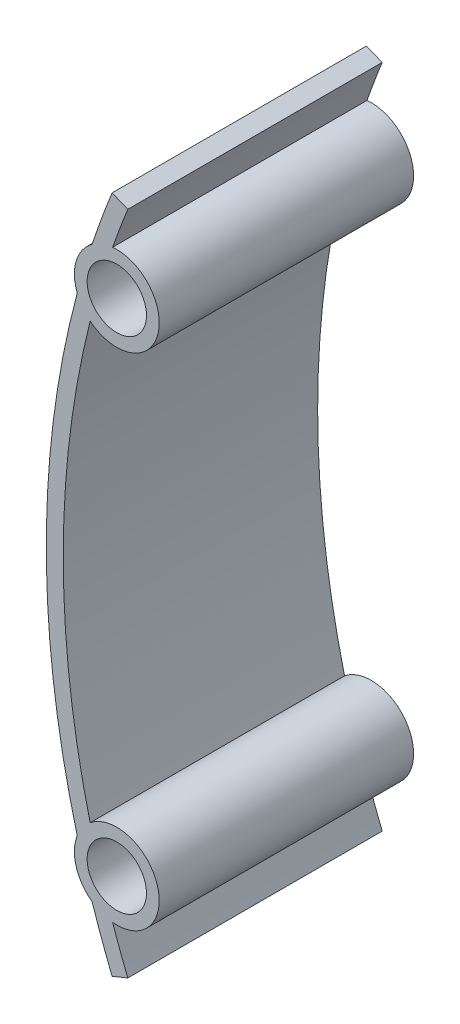
ISO-10303-21;
HEADER;
FILE_DESCRIPTION(('STEP AP214'),'2;1');
FILE_NAME('part.step','',(''),(''),'','','');
FILE_SCHEMA(('AUTOMOTIVE_DESIGN { 1 0 10303 214 1 1 1 1 }'));
ENDSEC;
DATA;
#1=APPLICATION_CONTEXT('core data for automotive mechanical design processes');
#2=APPLICATION_PROTOCOL_DEFINITION('international standard','automotive_design',2000,#1);
#3=PRODUCT_CONTEXT('',#1,'mechanical');
#4=PRODUCT('Part','Part','',(#3));
#5=PRODUCT_RELATED_PRODUCT_CATEGORY('part','',(#4));
#6=PRODUCT_DEFINITION_FORMATION('','',#4);
#7=PRODUCT_DEFINITION_CONTEXT('part definition',#1,'design');
#8=PRODUCT_DEFINITION('design','',#6,#7);
#9=PRODUCT_DEFINITION_SHAPE('','',#8);
#10=(LENGTH_UNIT() NAMED_UNIT(*) SI_UNIT(.MILLI.,.METRE.));
#11=(NAMED_UNIT(*) PLANE_ANGLE_UNIT() SI_UNIT($,.RADIAN.));
#12=(NAMED_UNIT(*) SI_UNIT($,.STERADIAN.) SOLID_ANGLE_UNIT());
#13=UNCERTAINTY_MEASURE_WITH_UNIT(LENGTH_MEASURE(1.E-05),#10,'distance_accuracy_value','');
#14=(GEOMETRIC_REPRESENTATION_CONTEXT(3) GLOBAL_UNCERTAINTY_ASSIGNED_CONTEXT((#13)) GLOBAL_UNIT_ASSIGNED_CONTEXT((#10,
#11,#12)) REPRESENTATION_CONTEXT('',''));
#15=CARTESIAN_POINT('',(0.,0.,0.));
#16=DIRECTION('',(0.,0.,1.));
#17=DIRECTION('',(1.,0.,0.));
#18=AXIS2_PLACEMENT_3D('',#15,#16,#17);
#19=CARTESIAN_POINT('',(107.,0.,30.));
#20=DIRECTION('',(0.,0.,1.));
#21=DIRECTION('',(1.,0.,0.));
#22=AXIS2_PLACEMENT_3D('',#19,#20,#21);
#23=PLANE('',#22);
#24=CARTESIAN_POINT('',(8.31489474089818,-29.5,30.));
#25=DIRECTION('',(0.,0.,1.));
#26=DIRECTION('',(1.,0.,0.));
#27=AXIS2_PLACEMENT_3D('',#24,#25,#26);
#28=CIRCLE('',#27,3.5);
#29=CARTESIAN_POINT('',(11.8148947408982,-29.5,30.));
#30=VERTEX_POINT('',#29);
#31=EDGE_CURVE('E162',#30,#30,#28,.T.);
#32=ORIENTED_EDGE('',*,*,#31,.F.);
#33=EDGE_LOOP('',(#32));
#34=FACE_BOUND('',#33,.T.);
#35=CARTESIAN_POINT('',(107.,0.,30.));
#36=DIRECTION('',(0.,0.,1.));
#37=DIRECTION('',(1.,0.,0.));
#38=AXIS2_PLACEMENT_3D('',#35,#36,#37);
#39=CIRCLE('',#38,107.);
#40=CARTESIAN_POINT('',(7.75787184869522,40.,30.));
#41=VERTEX_POINT('',#40);
#42=CARTESIAN_POINT('',(5.39998148846619,33.5624230122914,30.));
#43=VERTEX_POINT('',#42);
#44=EDGE_CURVE('E181',#41,#43,#39,.T.);
#45=ORIENTED_EDGE('',*,*,#44,.T.);
#46=CARTESIAN_POINT('',(8.31489474089818,29.5,30.));
#47=DIRECTION('',(0.,0.,1.));
#48=DIRECTION('',(1.,0.,0.));
#49=AXIS2_PLACEMENT_3D('',#46,#47,#48);
#50=CIRCLE('',#49,4.99999999999982);
#51=CARTESIAN_POINT('',(3.64866360779266,27.7038132022434,30.));
#52=VERTEX_POINT('',#51);
#53=EDGE_CURVE('E109',#43,#52,#50,.T.);
#54=ORIENTED_EDGE('',*,*,#53,.T.);
#55=CARTESIAN_POINT('',(107.,0.,30.));
#56=DIRECTION('',(0.,0.,1.));
#57=DIRECTION('',(1.,0.,0.));
#58=AXIS2_PLACEMENT_3D('',#55,#56,#57);
#59=CIRCLE('',#58,107.);
#60=CARTESIAN_POINT('',(3.64866360779257,-27.7038132022431,30.));
#61=VERTEX_POINT('',#60);
#62=EDGE_CURVE('E208',#52,#61,#59,.T.);
#63=ORIENTED_EDGE('',*,*,#62,.T.);
#64=CARTESIAN_POINT('',(8.31489474089818,-29.5,30.));
#65=DIRECTION('',(0.,0.,1.));
#66=DIRECTION('',(1.,0.,0.));
#67=AXIS2_PLACEMENT_3D('',#64,#65,#66);
#68=CIRCLE('',#67,5.00000000000001);
#69=CARTESIAN_POINT('',(5.39998148846628,-33.5624230122916,30.));
#70=VERTEX_POINT('',#69);
#71=EDGE_CURVE('E227',#61,#70,#68,.T.);
#72=ORIENTED_EDGE('',*,*,#71,.T.);
#73=CARTESIAN_POINT('',(107.,0.,30.));
#74=DIRECTION('',(0.,0.,1.));
#75=DIRECTION('',(1.,0.,0.));
#76=AXIS2_PLACEMENT_3D('',#73,#74,#75);
#77=CIRCLE('',#76,107.);
#78=CARTESIAN_POINT('',(7.75787184869522,-40.,30.));
#79=VERTEX_POINT('',#78);
#80=EDGE_CURVE('E224',#70,#79,#77,.T.);
#81=ORIENTED_EDGE('',*,*,#80,.T.);
#82=DIRECTION('',(0.92749652477855,0.373831775700932,0.));
#83=VECTOR('',#82,1.);
#84=CARTESIAN_POINT('',(7.75787184869522,-40.,30.));
#85=LINE('',#84,#83);
#86=CARTESIAN_POINT('',(9.61286489825233,-39.2523364485981,30.));
#87=VERTEX_POINT('',#86);
#88=EDGE_CURVE('E226',#79,#87,#85,.T.);
#89=ORIENTED_EDGE('',*,*,#88,.T.);
#90=CARTESIAN_POINT('',(107.,0.,30.));
#91=DIRECTION('',(0.,0.,-1.));
#92=DIRECTION('',(1.,0.,0.));
#93=AXIS2_PLACEMENT_3D('',#90,#91,#92);
#94=CIRCLE('',#93,105.);
#95=CARTESIAN_POINT('',(7.82119519222903,-34.4755663753631,30.));
#96=VERTEX_POINT('',#95);
#97=EDGE_CURVE('E229',#87,#96,#94,.T.);
#98=ORIENTED_EDGE('',*,*,#97,.T.);
#99=CARTESIAN_POINT('',(8.31489474089818,-29.5,30.));
#100=DIRECTION('',(0.,0.,1.));
#101=DIRECTION('',(1.,0.,0.));
#102=AXIS2_PLACEMENT_3D('',#99,#100,#101);
#103=CIRCLE('',#102,5.);
#104=CARTESIAN_POINT('',(5.17150538803955,-25.6116708760272,30.));
#105=VERTEX_POINT('',#104);
#106=EDGE_CURVE('E235',#96,#105,#103,.T.);
#107=ORIENTED_EDGE('',*,*,#106,.T.);
#108=CARTESIAN_POINT('',(107.,0.,30.));
#109=DIRECTION('',(0.,0.,-1.));
#110=DIRECTION('',(1.,0.,0.));
#111=AXIS2_PLACEMENT_3D('',#108,#109,#110);
#112=CIRCLE('',#111,105.);
#113=CARTESIAN_POINT('',(5.17150538803957,25.6116708760273,30.));
#114=VERTEX_POINT('',#113);
#115=EDGE_CURVE('E140',#105,#114,#112,.T.);
#116=ORIENTED_EDGE('',*,*,#115,.T.);
#117=CARTESIAN_POINT('',(8.31489474089818,29.5,30.));
#118=DIRECTION('',(0.,0.,1.));
#119=DIRECTION('',(1.,0.,0.));
#120=AXIS2_PLACEMENT_3D('',#117,#118,#119);
#121=CIRCLE('',#120,4.99999999999991);
#122=CARTESIAN_POINT('',(7.821195192229,34.475566375363,30.));
#123=VERTEX_POINT('',#122);
#124=EDGE_CURVE('E134',#114,#123,#121,.T.);
#125=ORIENTED_EDGE('',*,*,#124,.T.);
#126=CARTESIAN_POINT('',(107.,0.,30.));
#127=DIRECTION('',(0.,0.,-1.));
#128=DIRECTION('',(1.,0.,0.));
#129=AXIS2_PLACEMENT_3D('',#126,#127,#128);
#130=CIRCLE('',#129,105.);
#131=CARTESIAN_POINT('',(9.61286489825232,39.2523364485981,30.));
#132=VERTEX_POINT('',#131);
#133=EDGE_CURVE('E138',#123,#132,#130,.T.);
#134=ORIENTED_EDGE('',*,*,#133,.T.);
#135=DIRECTION('',(-0.927496524778549,0.373831775700935,0.));
#136=VECTOR('',#135,1.);
#137=CARTESIAN_POINT('',(7.75787184869522,40.,30.));
#138=LINE('',#137,#136);
#139=EDGE_CURVE('E54',#132,#41,#138,.T.);
#140=ORIENTED_EDGE('',*,*,#139,.T.);
#141=EDGE_LOOP('',(#45,#54,#63,#72,#81,#89,#98,#107,#116,#125,#134,#140));
#142=FACE_BOUND('',#141,.T.);
#143=CARTESIAN_POINT('',(8.31489474089818,29.5,30.));
#144=DIRECTION('',(0.,0.,1.));
#145=DIRECTION('',(1.,0.,0.));
#146=AXIS2_PLACEMENT_3D('',#143,#144,#145);
#147=CIRCLE('',#146,3.5);
#148=CARTESIAN_POINT('',(11.8148947408982,29.5,30.));
#149=VERTEX_POINT('',#148);
#150=EDGE_CURVE('E277',#149,#149,#147,.T.);
#151=ORIENTED_EDGE('',*,*,#150,.F.);
#152=EDGE_LOOP('',(#151));
#153=FACE_BOUND('',#152,.T.);
#154=ADVANCED_FACE('F37',(#34,#142,#153),#23,.T.);
#155=CARTESIAN_POINT('',(107.,0.,0.));
#156=DIRECTION('',(0.,0.,1.));
#157=DIRECTION('',(1.,0.,0.));
#158=AXIS2_PLACEMENT_3D('',#155,#156,#157);
#159=PLANE('',#158);
#160=CARTESIAN_POINT('',(107.,0.,0.));
#161=DIRECTION('',(0.,0.,1.));
#162=DIRECTION('',(1.,0.,0.));
#163=AXIS2_PLACEMENT_3D('',#160,#161,#162);
#164=CIRCLE('',#163,107.);
#165=CARTESIAN_POINT('',(7.75787184869522,40.,0.));
#166=VERTEX_POINT('',#165);
#167=CARTESIAN_POINT('',(5.39998148846619,33.5624230122914,0.));
#168=VERTEX_POINT('',#167);
#169=EDGE_CURVE('E158',#166,#168,#164,.T.);
#170=ORIENTED_EDGE('',*,*,#169,.F.);
#171=DIRECTION('',(-0.927496524778549,0.373831775700935,0.));
#172=VECTOR('',#171,1.);
#173=CARTESIAN_POINT('',(7.75787184869522,40.,0.));
#174=LINE('',#173,#172);
#175=CARTESIAN_POINT('',(9.61286489825232,39.2523364485981,0.));
#176=VERTEX_POINT('',#175);
#177=EDGE_CURVE('E101',#176,#166,#174,.T.);
#178=ORIENTED_EDGE('',*,*,#177,.F.);
#179=CARTESIAN_POINT('',(107.,0.,0.));
#180=DIRECTION('',(0.,0.,-1.));
#181=DIRECTION('',(1.,0.,0.));
#182=AXIS2_PLACEMENT_3D('',#179,#180,#181);
#183=CIRCLE('',#182,105.);
#184=CARTESIAN_POINT('',(7.821195192229,34.475566375363,0.));
#185=VERTEX_POINT('',#184);
#186=EDGE_CURVE('E95',#185,#176,#183,.T.);
#187=ORIENTED_EDGE('',*,*,#186,.F.);
#188=CARTESIAN_POINT('',(8.31489474089818,29.5,0.));
#189=DIRECTION('',(0.,0.,1.));
#190=DIRECTION('',(1.,0.,0.));
#191=AXIS2_PLACEMENT_3D('',#188,#189,#190);
#192=CIRCLE('',#191,4.99999999999991);
#193=CARTESIAN_POINT('',(5.17150538803957,25.6116708760273,0.));
#194=VERTEX_POINT('',#193);
#195=EDGE_CURVE('E148',#194,#185,#192,.T.);
#196=ORIENTED_EDGE('',*,*,#195,.F.);
#197=CARTESIAN_POINT('',(107.,0.,0.));
#198=DIRECTION('',(0.,0.,-1.));
#199=DIRECTION('',(1.,0.,0.));
#200=AXIS2_PLACEMENT_3D('',#197,#198,#199);
#201=CIRCLE('',#200,105.);
#202=CARTESIAN_POINT('',(5.17150538803955,-25.6116708760272,0.));
#203=VERTEX_POINT('',#202);
#204=EDGE_CURVE('E176',#203,#194,#201,.T.);
#205=ORIENTED_EDGE('',*,*,#204,.F.);
#206=CARTESIAN_POINT('',(8.31489474089818,-29.5,0.));
#207=DIRECTION('',(0.,0.,1.));
#208=DIRECTION('',(1.,0.,0.));
#209=AXIS2_PLACEMENT_3D('',#206,#207,#208);
#210=CIRCLE('',#209,5.);
#211=CARTESIAN_POINT('',(7.82119519222903,-34.4755663753631,0.));
#212=VERTEX_POINT('',#211);
#213=EDGE_CURVE('E174',#212,#203,#210,.T.);
#214=ORIENTED_EDGE('',*,*,#213,.F.);
#215=CARTESIAN_POINT('',(107.,0.,0.));
#216=DIRECTION('',(0.,0.,-1.));
#217=DIRECTION('',(1.,0.,0.));
#218=AXIS2_PLACEMENT_3D('',#215,#216,#217);
#219=CIRCLE('',#218,105.);
#220=CARTESIAN_POINT('',(9.61286489825233,-39.2523364485981,0.));
#221=VERTEX_POINT('',#220);
#222=EDGE_CURVE('E172',#221,#212,#219,.T.);
#223=ORIENTED_EDGE('',*,*,#222,.F.);
#224=DIRECTION('',(0.92749652477855,0.373831775700932,0.));
#225=VECTOR('',#224,1.);
#226=CARTESIAN_POINT('',(7.75787184869522,-40.,0.));
#227=LINE('',#226,#225);
#228=CARTESIAN_POINT('',(7.75787184869522,-40.,0.));
#229=VERTEX_POINT('',#228);
#230=EDGE_CURVE('E170',#229,#221,#227,.T.);
#231=ORIENTED_EDGE('',*,*,#230,.F.);
#232=CARTESIAN_POINT('',(107.,0.,0.));
#233=DIRECTION('',(0.,0.,1.));
#234=DIRECTION('',(1.,0.,0.));
#235=AXIS2_PLACEMENT_3D('',#232,#233,#234);
#236=CIRCLE('',#235,107.);
#237=CARTESIAN_POINT('',(5.39998148846628,-33.5624230122916,0.));
#238=VERTEX_POINT('',#237);
#239=EDGE_CURVE('E168',#238,#229,#236,.T.);
#240=ORIENTED_EDGE('',*,*,#239,.F.);
#241=CARTESIAN_POINT('',(8.31489474089818,-29.5,0.));
#242=DIRECTION('',(0.,0.,1.));
#243=DIRECTION('',(1.,0.,0.));
#244=AXIS2_PLACEMENT_3D('',#241,#242,#243);
#245=CIRCLE('',#244,5.00000000000001);
#246=CARTESIAN_POINT('',(3.64866360779257,-27.7038132022431,0.));
#247=VERTEX_POINT('',#246);
#248=EDGE_CURVE('E166',#247,#238,#245,.T.);
#249=ORIENTED_EDGE('',*,*,#248,.F.);
#250=CARTESIAN_POINT('',(107.,0.,0.));
#251=DIRECTION('',(0.,0.,1.));
#252=DIRECTION('',(1.,0.,0.));
#253=AXIS2_PLACEMENT_3D('',#250,#251,#252);
#254=CIRCLE('',#253,107.);
#255=CARTESIAN_POINT('',(3.64866360779266,27.7038132022434,0.));
#256=VERTEX_POINT('',#255);
#257=EDGE_CURVE('E164',#256,#247,#254,.T.);
#258=ORIENTED_EDGE('',*,*,#257,.F.);
#259=CARTESIAN_POINT('',(8.31489474089818,29.5,0.));
#260=DIRECTION('',(0.,0.,1.));
#261=DIRECTION('',(1.,0.,0.));
#262=AXIS2_PLACEMENT_3D('',#259,#260,#261);
#263=CIRCLE('',#262,4.99999999999982);
#264=EDGE_CURVE('E161',#168,#256,#263,.T.);
#265=ORIENTED_EDGE('',*,*,#264,.F.);
#266=EDGE_LOOP('',(#170,#178,#187,#196,#205,#214,#223,#231,#240,#249,#258,#265));
#267=FACE_BOUND('',#266,.T.);
#268=CARTESIAN_POINT('',(8.31489474089818,-29.5,0.));
#269=DIRECTION('',(0.,0.,1.));
#270=DIRECTION('',(1.,0.,0.));
#271=AXIS2_PLACEMENT_3D('',#268,#269,#270);
#272=CIRCLE('',#271,3.5);
#273=CARTESIAN_POINT('',(11.8148947408982,-29.5,0.));
#274=VERTEX_POINT('',#273);
#275=EDGE_CURVE('E283',#274,#274,#272,.T.);
#276=ORIENTED_EDGE('',*,*,#275,.T.);
#277=EDGE_LOOP('',(#276));
#278=FACE_BOUND('',#277,.T.);
#279=CARTESIAN_POINT('',(8.31489474089818,29.5,0.));
#280=DIRECTION('',(0.,0.,1.));
#281=DIRECTION('',(1.,0.,0.));
#282=AXIS2_PLACEMENT_3D('',#279,#280,#281);
#283=CIRCLE('',#282,3.5);
#284=CARTESIAN_POINT('',(11.8148947408982,29.5,0.));
#285=VERTEX_POINT('',#284);
#286=EDGE_CURVE('E280',#285,#285,#283,.T.);
#287=ORIENTED_EDGE('',*,*,#286,.T.);
#288=EDGE_LOOP('',(#287));
#289=FACE_BOUND('',#288,.T.);
#290=ADVANCED_FACE('F212',(#267,#278,#289),#159,.F.);
#291=CARTESIAN_POINT('',(107.,0.,30.));
#292=DIRECTION('',(0.,0.,-1.));
#293=DIRECTION('',(-1.,0.,0.));
#294=AXIS2_PLACEMENT_3D('',#291,#292,#293);
#295=CYLINDRICAL_SURFACE('',#294,107.);
#296=ORIENTED_EDGE('',*,*,#169,.T.);
#297=DIRECTION('',(0.,0.,-1.));
#298=VECTOR('',#297,1.);
#299=CARTESIAN_POINT('',(5.39998148846619,33.5624230122914,30.));
#300=LINE('',#299,#298);
#301=EDGE_CURVE('E11',#43,#168,#300,.T.);
#302=ORIENTED_EDGE('',*,*,#301,.F.);
#303=ORIENTED_EDGE('',*,*,#44,.F.);
#304=DIRECTION('',(0.,0.,-1.));
#305=VECTOR('',#304,1.);
#306=CARTESIAN_POINT('',(7.75787184869522,40.,30.));
#307=LINE('',#306,#305);
#308=EDGE_CURVE('E154',#41,#166,#307,.T.);
#309=ORIENTED_EDGE('',*,*,#308,.T.);
#310=EDGE_LOOP('',(#296,#302,#303,#309));
#311=FACE_BOUND('',#310,.T.);
#312=ADVANCED_FACE('F39',(#311),#295,.T.);
#313=CARTESIAN_POINT('',(8.31489474089818,29.5,30.));
#314=DIRECTION('',(0.,0.,-1.));
#315=DIRECTION('',(-1.,0.,0.));
#316=AXIS2_PLACEMENT_3D('',#313,#314,#315);
#317=CYLINDRICAL_SURFACE('',#316,4.99999999999982);
#318=ORIENTED_EDGE('',*,*,#264,.T.);
#319=DIRECTION('',(0.,0.,-1.));
#320=VECTOR('',#319,1.);
#321=CARTESIAN_POINT('',(3.64866360779266,27.7038132022434,30.));
#322=LINE('',#321,#320);
#323=EDGE_CURVE('E46',#52,#256,#322,.T.);
#324=ORIENTED_EDGE('',*,*,#323,.F.);
#325=ORIENTED_EDGE('',*,*,#53,.F.);
#326=ORIENTED_EDGE('',*,*,#301,.T.);
#327=EDGE_LOOP('',(#318,#324,#325,#326));
#328=FACE_BOUND('',#327,.T.);
#329=ADVANCED_FACE('F386',(#328),#317,.T.);
#330=CARTESIAN_POINT('',(107.,0.,30.));
#331=DIRECTION('',(0.,0.,-1.));
#332=DIRECTION('',(-1.,0.,0.));
#333=AXIS2_PLACEMENT_3D('',#330,#331,#332);
#334=CYLINDRICAL_SURFACE('',#333,107.);
#335=ORIENTED_EDGE('',*,*,#257,.T.);
#336=DIRECTION('',(0.,0.,-1.));
#337=VECTOR('',#336,1.);
#338=CARTESIAN_POINT('',(3.64866360779257,-27.7038132022431,30.));
#339=LINE('',#338,#337);
#340=EDGE_CURVE('E200',#61,#247,#339,.T.);
#341=ORIENTED_EDGE('',*,*,#340,.F.);
#342=ORIENTED_EDGE('',*,*,#62,.F.);
#343=ORIENTED_EDGE('',*,*,#323,.T.);
#344=EDGE_LOOP('',(#335,#341,#342,#343));
#345=FACE_BOUND('',#344,.T.);
#346=ADVANCED_FACE('F206',(#345),#334,.T.);
#347=CARTESIAN_POINT('',(8.31489474089818,-29.5,30.));
#348=DIRECTION('',(0.,0.,-1.));
#349=DIRECTION('',(-1.,0.,0.));
#350=AXIS2_PLACEMENT_3D('',#347,#348,#349);
#351=CYLINDRICAL_SURFACE('',#350,5.00000000000001);
#352=ORIENTED_EDGE('',*,*,#248,.T.);
#353=DIRECTION('',(0.,0.,-1.));
#354=VECTOR('',#353,1.);
#355=CARTESIAN_POINT('',(5.39998148846628,-33.5624230122916,30.));
#356=LINE('',#355,#354);
#357=EDGE_CURVE('E197',#70,#238,#356,.T.);
#358=ORIENTED_EDGE('',*,*,#357,.F.);
#359=ORIENTED_EDGE('',*,*,#71,.F.);
#360=ORIENTED_EDGE('',*,*,#340,.T.);
#361=EDGE_LOOP('',(#352,#358,#359,#360));
#362=FACE_BOUND('',#361,.T.);
#363=ADVANCED_FACE('F218',(#362),#351,.T.);
#364=CARTESIAN_POINT('',(107.,0.,30.));
#365=DIRECTION('',(0.,0.,-1.));
#366=DIRECTION('',(-1.,0.,0.));
#367=AXIS2_PLACEMENT_3D('',#364,#365,#366);
#368=CYLINDRICAL_SURFACE('',#367,107.);
#369=ORIENTED_EDGE('',*,*,#239,.T.);
#370=DIRECTION('',(0.,0.,-1.));
#371=VECTOR('',#370,1.);
#372=CARTESIAN_POINT('',(7.75787184869522,-40.,30.));
#373=LINE('',#372,#371);
#374=EDGE_CURVE('E194',#79,#229,#373,.T.);
#375=ORIENTED_EDGE('',*,*,#374,.F.);
#376=ORIENTED_EDGE('',*,*,#80,.F.);
#377=ORIENTED_EDGE('',*,*,#357,.T.);
#378=EDGE_LOOP('',(#369,#375,#376,#377));
#379=FACE_BOUND('',#378,.T.);
#380=ADVANCED_FACE('F222',(#379),#368,.T.);
#381=CARTESIAN_POINT('',(7.75787184869522,-40.,30.));
#382=DIRECTION('',(-0.373831775700932,0.92749652477855,0.));
#383=DIRECTION('',(-0.927496524778551,-0.373831775700932,0.));
#384=AXIS2_PLACEMENT_3D('',#381,#382,#383);
#385=PLANE('',#384);
#386=ORIENTED_EDGE('',*,*,#230,.T.);
#387=DIRECTION('',(0.,0.,-1.));
#388=VECTOR('',#387,1.);
#389=CARTESIAN_POINT('',(9.61286489825233,-39.2523364485981,30.));
#390=LINE('',#389,#388);
#391=EDGE_CURVE('E191',#87,#221,#390,.T.);
#392=ORIENTED_EDGE('',*,*,#391,.F.);
#393=ORIENTED_EDGE('',*,*,#88,.F.);
#394=ORIENTED_EDGE('',*,*,#374,.T.);
#395=EDGE_LOOP('',(#386,#392,#393,#394));
#396=FACE_BOUND('',#395,.T.);
#397=ADVANCED_FACE('F347',(#396),#385,.F.);
#398=CARTESIAN_POINT('',(107.,0.,30.));
#399=DIRECTION('',(0.,0.,-1.));
#400=DIRECTION('',(-1.,0.,0.));
#401=AXIS2_PLACEMENT_3D('',#398,#399,#400);
#402=CYLINDRICAL_SURFACE('',#401,105.);
#403=ORIENTED_EDGE('',*,*,#222,.T.);
#404=DIRECTION('',(0.,0.,-1.));
#405=VECTOR('',#404,1.);
#406=CARTESIAN_POINT('',(7.82119519222903,-34.4755663753631,30.));
#407=LINE('',#406,#405);
#408=EDGE_CURVE('E188',#96,#212,#407,.T.);
#409=ORIENTED_EDGE('',*,*,#408,.F.);
#410=ORIENTED_EDGE('',*,*,#97,.F.);
#411=ORIENTED_EDGE('',*,*,#391,.T.);
#412=EDGE_LOOP('',(#403,#409,#410,#411));
#413=FACE_BOUND('',#412,.T.);
#414=ADVANCED_FACE('F337',(#413),#402,.F.);
#415=CARTESIAN_POINT('',(8.31489474089818,-29.5,30.));
#416=DIRECTION('',(0.,0.,-1.));
#417=DIRECTION('',(-1.,0.,0.));
#418=AXIS2_PLACEMENT_3D('',#415,#416,#417);
#419=CYLINDRICAL_SURFACE('',#418,5.);
#420=ORIENTED_EDGE('',*,*,#213,.T.);
#421=DIRECTION('',(0.,0.,-1.));
#422=VECTOR('',#421,1.);
#423=CARTESIAN_POINT('',(5.17150538803955,-25.6116708760272,30.));
#424=LINE('',#423,#422);
#425=EDGE_CURVE('E185',#105,#203,#424,.T.);
#426=ORIENTED_EDGE('',*,*,#425,.F.);
#427=ORIENTED_EDGE('',*,*,#106,.F.);
#428=ORIENTED_EDGE('',*,*,#408,.T.);
#429=EDGE_LOOP('',(#420,#426,#427,#428));
#430=FACE_BOUND('',#429,.T.);
#431=ADVANCED_FACE('F241',(#430),#419,.T.);
#432=CARTESIAN_POINT('',(107.,0.,30.));
#433=DIRECTION('',(0.,0.,-1.));
#434=DIRECTION('',(-1.,0.,0.));
#435=AXIS2_PLACEMENT_3D('',#432,#433,#434);
#436=CYLINDRICAL_SURFACE('',#435,105.);
#437=ORIENTED_EDGE('',*,*,#204,.T.);
#438=DIRECTION('',(0.,0.,-1.));
#439=VECTOR('',#438,1.);
#440=CARTESIAN_POINT('',(5.17150538803957,25.6116708760273,30.));
#441=LINE('',#440,#439);
#442=EDGE_CURVE('E149',#114,#194,#441,.T.);
#443=ORIENTED_EDGE('',*,*,#442,.F.);
#444=ORIENTED_EDGE('',*,*,#115,.F.);
#445=ORIENTED_EDGE('',*,*,#425,.T.);
#446=EDGE_LOOP('',(#437,#443,#444,#445));
#447=FACE_BOUND('',#446,.T.);
#448=ADVANCED_FACE('F245',(#447),#436,.F.);
#449=CARTESIAN_POINT('',(8.31489474089818,29.5,30.));
#450=DIRECTION('',(0.,0.,-1.));
#451=DIRECTION('',(-1.,0.,0.));
#452=AXIS2_PLACEMENT_3D('',#449,#450,#451);
#453=CYLINDRICAL_SURFACE('',#452,4.99999999999991);
#454=ORIENTED_EDGE('',*,*,#195,.T.);
#455=DIRECTION('',(0.,0.,-1.));
#456=VECTOR('',#455,1.);
#457=CARTESIAN_POINT('',(7.821195192229,34.475566375363,30.));
#458=LINE('',#457,#456);
#459=EDGE_CURVE('E145',#123,#185,#458,.T.);
#460=ORIENTED_EDGE('',*,*,#459,.F.);
#461=ORIENTED_EDGE('',*,*,#124,.F.);
#462=ORIENTED_EDGE('',*,*,#442,.T.);
#463=EDGE_LOOP('',(#454,#460,#461,#462));
#464=FACE_BOUND('',#463,.T.);
#465=ADVANCED_FACE('F146',(#464),#453,.T.);
#466=CARTESIAN_POINT('',(107.,0.,30.));
#467=DIRECTION('',(0.,0.,-1.));
#468=DIRECTION('',(-1.,0.,0.));
#469=AXIS2_PLACEMENT_3D('',#466,#467,#468);
#470=CYLINDRICAL_SURFACE('',#469,105.);
#471=ORIENTED_EDGE('',*,*,#186,.T.);
#472=DIRECTION('',(0.,0.,-1.));
#473=VECTOR('',#472,1.);
#474=CARTESIAN_POINT('',(9.61286489825232,39.2523364485981,30.));
#475=LINE('',#474,#473);
#476=EDGE_CURVE('E150',#132,#176,#475,.T.);
#477=ORIENTED_EDGE('',*,*,#476,.F.);
#478=ORIENTED_EDGE('',*,*,#133,.F.);
#479=ORIENTED_EDGE('',*,*,#459,.T.);
#480=EDGE_LOOP('',(#471,#477,#478,#479));
#481=FACE_BOUND('',#480,.T.);
#482=ADVANCED_FACE('F152',(#481),#470,.F.);
#483=CARTESIAN_POINT('',(7.75787184869522,40.,30.));
#484=DIRECTION('',(-0.373831775700935,-0.927496524778549,0.));
#485=DIRECTION('',(0.927496524778549,-0.373831775700935,0.));
#486=AXIS2_PLACEMENT_3D('',#483,#484,#485);
#487=PLANE('',#486);
#488=ORIENTED_EDGE('',*,*,#177,.T.);
#489=ORIENTED_EDGE('',*,*,#308,.F.);
#490=ORIENTED_EDGE('',*,*,#139,.F.);
#491=ORIENTED_EDGE('',*,*,#476,.T.);
#492=EDGE_LOOP('',(#488,#489,#490,#491));
#493=FACE_BOUND('',#492,.T.);
#494=ADVANCED_FACE('F249',(#493),#487,.F.);
#495=CARTESIAN_POINT('',(8.31489474089818,-29.5,30.));
#496=DIRECTION('',(0.,0.,-1.));
#497=DIRECTION('',(-1.,0.,0.));
#498=AXIS2_PLACEMENT_3D('',#495,#496,#497);
#499=CYLINDRICAL_SURFACE('',#498,3.5);
#500=ORIENTED_EDGE('',*,*,#31,.T.);
#501=EDGE_LOOP('',(#500));
#502=FACE_BOUND('',#501,.T.);
#503=ORIENTED_EDGE('',*,*,#275,.F.);
#504=EDGE_LOOP('',(#503));
#505=FACE_BOUND('',#504,.T.);
#506=ADVANCED_FACE('F251',(#502,#505),#499,.F.);
#507=CARTESIAN_POINT('',(8.31489474089818,29.5,30.));
#508=DIRECTION('',(0.,0.,-1.));
#509=DIRECTION('',(-1.,0.,0.));
#510=AXIS2_PLACEMENT_3D('',#507,#508,#509);
#511=CYLINDRICAL_SURFACE('',#510,3.5);
#512=ORIENTED_EDGE('',*,*,#150,.T.);
#513=EDGE_LOOP('',(#512));
#514=FACE_BOUND('',#513,.T.);
#515=ORIENTED_EDGE('',*,*,#286,.F.);
#516=EDGE_LOOP('',(#515));
#517=FACE_BOUND('',#516,.T.);
#518=ADVANCED_FACE('F257',(#514,#517),#511,.F.);
#519=CLOSED_SHELL('',(#154,#290,#312,#329,#346,#363,#380,#397,#414,#431,#448,#465,#482,#494,
#506,#518));
#520=MANIFOLD_SOLID_BREP('B2',#519);
#521=ADVANCED_BREP_SHAPE_REPRESENTATION('',(#18,#520),#14);
#522=SHAPE_DEFINITION_REPRESENTATION(#9,#521);
ENDSEC;
END-ISO-10303-21;
